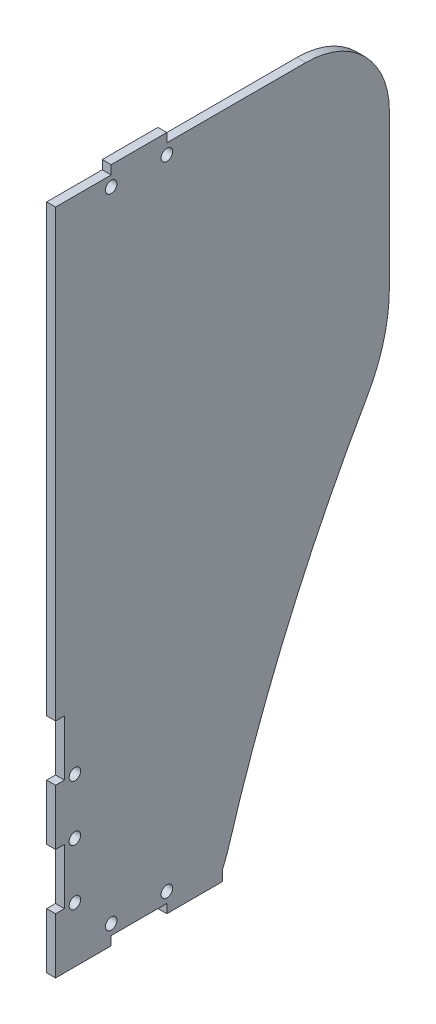
ISO-10303-21;
HEADER;
FILE_DESCRIPTION(('STEP AP214'),'2;1');
FILE_NAME('part.step','',(''),(''),'','','');
FILE_SCHEMA(('AUTOMOTIVE_DESIGN { 1 0 10303 214 1 1 1 1 }'));
ENDSEC;
DATA;
#1=APPLICATION_CONTEXT('core data for automotive mechanical design processes');
#2=APPLICATION_PROTOCOL_DEFINITION('international standard','automotive_design',2000,#1);
#3=PRODUCT_CONTEXT('',#1,'mechanical');
#4=PRODUCT('Part','Part','',(#3));
#5=PRODUCT_RELATED_PRODUCT_CATEGORY('part','',(#4));
#6=PRODUCT_DEFINITION_FORMATION('','',#4);
#7=PRODUCT_DEFINITION_CONTEXT('part definition',#1,'design');
#8=PRODUCT_DEFINITION('design','',#6,#7);
#9=PRODUCT_DEFINITION_SHAPE('','',#8);
#10=(LENGTH_UNIT() NAMED_UNIT(*) SI_UNIT(.MILLI.,.METRE.));
#11=(NAMED_UNIT(*) PLANE_ANGLE_UNIT() SI_UNIT($,.RADIAN.));
#12=(NAMED_UNIT(*) SI_UNIT($,.STERADIAN.) SOLID_ANGLE_UNIT());
#13=UNCERTAINTY_MEASURE_WITH_UNIT(LENGTH_MEASURE(1.E-05),#10,'distance_accuracy_value','');
#14=(GEOMETRIC_REPRESENTATION_CONTEXT(3) GLOBAL_UNCERTAINTY_ASSIGNED_CONTEXT((#13)) GLOBAL_UNIT_ASSIGNED_CONTEXT((#10,
#11,#12)) REPRESENTATION_CONTEXT('',''));
#15=CARTESIAN_POINT('',(0.,0.,0.));
#16=DIRECTION('',(0.,0.,1.));
#17=DIRECTION('',(1.,0.,0.));
#18=AXIS2_PLACEMENT_3D('',#15,#16,#17);
#19=CARTESIAN_POINT('',(0.,-416.449999966,33.3375));
#20=DIRECTION('',(-1.,0.,0.));
#21=DIRECTION('',(0.,0.,1.));
#22=AXIS2_PLACEMENT_3D('',#19,#20,#21);
#23=CYLINDRICAL_SURFACE('',#22,38.0999999999999);
#24=DIRECTION('',(1.,0.,0.));
#25=VECTOR('',#24,1.);
#26=CARTESIAN_POINT('',(0.,-378.350000009677,33.3375));
#27=LINE('',#26,#25);
#28=CARTESIAN_POINT('',(-4.064,-378.349999987839,33.3375));
#29=VERTEX_POINT('',#28);
#30=CARTESIAN_POINT('',(0.,-378.349999987839,33.3375));
#31=VERTEX_POINT('',#30);
#32=EDGE_CURVE('E360',#29,#31,#27,.T.);
#33=ORIENTED_EDGE('',*,*,#32,.T.);
#34=CARTESIAN_POINT('',(0.,-416.449999966,33.3375));
#35=DIRECTION('',(-1.,0.,0.));
#36=DIRECTION('',(0.,0.,1.));
#37=AXIS2_PLACEMENT_3D('',#34,#35,#36);
#38=CIRCLE('',#37,38.0999999999999);
#39=CARTESIAN_POINT('',(0.,-416.449999966,-4.76250000008065));
#40=VERTEX_POINT('',#39);
#41=EDGE_CURVE('E211',#31,#40,#38,.T.);
#42=ORIENTED_EDGE('',*,*,#41,.T.);
#43=DIRECTION('',(1.,0.,0.));
#44=VECTOR('',#43,1.);
#45=CARTESIAN_POINT('',(0.,-416.449999966,-4.76250000016129));
#46=LINE('',#45,#44);
#47=CARTESIAN_POINT('',(-4.06399999987097,-416.449999966,-4.76250000012097));
#48=VERTEX_POINT('',#47);
#49=EDGE_CURVE('E362',#40,#48,#46,.F.);
#50=ORIENTED_EDGE('',*,*,#49,.T.);
#51=CARTESIAN_POINT('',(-4.064,-416.449999966,33.3375));
#52=DIRECTION('',(-1.,0.,0.));
#53=DIRECTION('',(0.,0.,1.));
#54=AXIS2_PLACEMENT_3D('',#51,#52,#53);
#55=CIRCLE('',#54,38.0999999999999);
#56=EDGE_CURVE('E237',#48,#29,#55,.F.);
#57=ORIENTED_EDGE('',*,*,#56,.T.);
#58=EDGE_LOOP('',(#33,#42,#50,#57));
#59=FACE_BOUND('',#58,.T.);
#60=ADVANCED_FACE('F17',(#59),#23,.T.);
#61=CARTESIAN_POINT('',(0.,0.,122.237499976613));
#62=DIRECTION('',(0.,0.,-1.));
#63=DIRECTION('',(-1.,0.,0.));
#64=AXIS2_PLACEMENT_3D('',#61,#62,#63);
#65=PLANE('',#64);
#66=DIRECTION('',(1.,0.,0.));
#67=VECTOR('',#66,1.);
#68=CARTESIAN_POINT('',(0.,-378.350000009677,122.2375));
#69=LINE('',#68,#67);
#70=CARTESIAN_POINT('',(-4.06399999974193,-378.349999980559,122.2375));
#71=VERTEX_POINT('',#70);
#72=CARTESIAN_POINT('',(0.,-378.349999980559,122.237499996102));
#73=VERTEX_POINT('',#72);
#74=EDGE_CURVE('E382',#71,#73,#69,.T.);
#75=ORIENTED_EDGE('',*,*,#74,.T.);
#76=DIRECTION('',(0.,1.,0.));
#77=VECTOR('',#76,1.);
#78=CARTESIAN_POINT('',(0.,0.,122.2375));
#79=LINE('',#78,#77);
#80=CARTESIAN_POINT('',(0.,-374.28599999443,122.2375));
#81=VERTEX_POINT('',#80);
#82=EDGE_CURVE('E345',#73,#81,#79,.T.);
#83=ORIENTED_EDGE('',*,*,#82,.T.);
#84=DIRECTION('',(1.,0.,0.));
#85=VECTOR('',#84,1.);
#86=CARTESIAN_POINT('',(0.,-374.286000008645,122.2375));
#87=LINE('',#86,#85);
#88=CARTESIAN_POINT('',(-4.06399999982796,-374.285999980215,122.2375));
#89=VERTEX_POINT('',#88);
#90=EDGE_CURVE('E240',#81,#89,#87,.F.);
#91=ORIENTED_EDGE('',*,*,#90,.T.);
#92=DIRECTION('',(0.,1.,0.));
#93=VECTOR('',#92,1.);
#94=CARTESIAN_POINT('',(-4.06399999974193,0.,122.2375));
#95=LINE('',#94,#93);
#96=EDGE_CURVE('E375',#89,#71,#95,.F.);
#97=ORIENTED_EDGE('',*,*,#96,.T.);
#98=EDGE_LOOP('',(#75,#83,#91,#97));
#99=FACE_BOUND('',#98,.T.);
#100=ADVANCED_FACE('F546',(#99),#65,.F.);
#101=CARTESIAN_POINT('',(0.,-378.350000009677,0.));
#102=DIRECTION('',(0.,-1.,0.));
#103=DIRECTION('',(0.,0.,-1.));
#104=AXIS2_PLACEMENT_3D('',#101,#102,#103);
#105=PLANE('',#104);
#106=DIRECTION('',(0.,0.,1.));
#107=VECTOR('',#106,1.);
#108=CARTESIAN_POINT('',(-4.06399999974193,-378.349999966,0.));
#109=LINE('',#108,#107);
#110=CARTESIAN_POINT('',(-4.06399999974193,-378.349999966,147.637500005108));
#111=VERTEX_POINT('',#110);
#112=EDGE_CURVE('E379',#71,#111,#109,.T.);
#113=ORIENTED_EDGE('',*,*,#112,.T.);
#114=DIRECTION('',(1.,0.,0.));
#115=VECTOR('',#114,1.);
#116=CARTESIAN_POINT('',(0.,-378.349999966,147.637500015323));
#117=LINE('',#116,#115);
#118=CARTESIAN_POINT('',(0.,-378.34999997328,147.637500005108));
#119=VERTEX_POINT('',#118);
#120=EDGE_CURVE('E384',#111,#119,#117,.T.);
#121=ORIENTED_EDGE('',*,*,#120,.T.);
#122=DIRECTION('',(0.,0.,1.));
#123=VECTOR('',#122,1.);
#124=CARTESIAN_POINT('',(0.,-378.349999966,0.));
#125=LINE('',#124,#123);
#126=EDGE_CURVE('E340',#119,#73,#125,.F.);
#127=ORIENTED_EDGE('',*,*,#126,.T.);
#128=ORIENTED_EDGE('',*,*,#74,.F.);
#129=EDGE_LOOP('',(#113,#121,#127,#128));
#130=FACE_BOUND('',#129,.T.);
#131=ADVANCED_FACE('F553',(#130),#105,.F.);
#132=CARTESIAN_POINT('',(0.,0.,147.637500015323));
#133=DIRECTION('',(0.,0.,1.));
#134=DIRECTION('',(1.,0.,0.));
#135=AXIS2_PLACEMENT_3D('',#132,#133,#134);
#136=PLANE('',#135);
#137=DIRECTION('',(0.,1.,0.));
#138=VECTOR('',#137,1.);
#139=CARTESIAN_POINT('',(0.,0.,147.6375));
#140=LINE('',#139,#138);
#141=CARTESIAN_POINT('',(0.,-581.549999976258,147.637500002554));
#142=VERTEX_POINT('',#141);
#143=EDGE_CURVE('E335',#142,#119,#140,.T.);
#144=ORIENTED_EDGE('',*,*,#143,.T.);
#145=ORIENTED_EDGE('',*,*,#120,.F.);
#146=DIRECTION('',(0.,1.,0.));
#147=VECTOR('',#146,1.);
#148=CARTESIAN_POINT('',(-4.06399999974193,0.,147.6375));
#149=LINE('',#148,#147);
#150=CARTESIAN_POINT('',(-4.06399999974193,-581.549999976258,147.6375));
#151=VERTEX_POINT('',#150);
#152=EDGE_CURVE('E388',#111,#151,#149,.F.);
#153=ORIENTED_EDGE('',*,*,#152,.T.);
#154=DIRECTION('',(1.,0.,0.));
#155=VECTOR('',#154,1.);
#156=CARTESIAN_POINT('',(0.,-581.549999996774,147.6375));
#157=LINE('',#156,#155);
#158=EDGE_CURVE('E392',#151,#142,#157,.T.);
#159=ORIENTED_EDGE('',*,*,#158,.T.);
#160=EDGE_LOOP('',(#144,#145,#153,#159));
#161=FACE_BOUND('',#160,.T.);
#162=ADVANCED_FACE('F557',(#161),#136,.T.);
#163=CARTESIAN_POINT('',(0.,-581.549999996774,0.));
#164=DIRECTION('',(0.,-1.,0.));
#165=DIRECTION('',(0.,0.,-1.));
#166=AXIS2_PLACEMENT_3D('',#163,#164,#165);
#167=PLANE('',#166);
#168=DIRECTION('',(0.,0.,1.));
#169=VECTOR('',#168,1.);
#170=CARTESIAN_POINT('',(0.,-581.549999966,0.));
#171=LINE('',#170,#169);
#172=CARTESIAN_POINT('',(0.,-581.549999971129,143.573500004763));
#173=VERTEX_POINT('',#172);
#174=EDGE_CURVE('E330',#173,#142,#171,.T.);
#175=ORIENTED_EDGE('',*,*,#174,.T.);
#176=ORIENTED_EDGE('',*,*,#158,.F.);
#177=DIRECTION('',(0.,0.,1.));
#178=VECTOR('',#177,1.);
#179=CARTESIAN_POINT('',(-4.06399999974193,-581.549999966,0.));
#180=LINE('',#179,#178);
#181=CARTESIAN_POINT('',(-4.06399999974193,-581.549999966,143.573500004763));
#182=VERTEX_POINT('',#181);
#183=EDGE_CURVE('E396',#151,#182,#180,.F.);
#184=ORIENTED_EDGE('',*,*,#183,.T.);
#185=DIRECTION('',(1.,0.,0.));
#186=VECTOR('',#185,1.);
#187=CARTESIAN_POINT('',(0.,-581.549999966,143.57350001429));
#188=LINE('',#187,#186);
#189=EDGE_CURVE('E400',#182,#173,#188,.T.);
#190=ORIENTED_EDGE('',*,*,#189,.T.);
#191=EDGE_LOOP('',(#175,#176,#184,#190));
#192=FACE_BOUND('',#191,.T.);
#193=ADVANCED_FACE('F561',(#192),#167,.T.);
#194=CARTESIAN_POINT('',(0.,0.,143.57350001429));
#195=DIRECTION('',(0.,0.,1.));
#196=DIRECTION('',(1.,0.,0.));
#197=AXIS2_PLACEMENT_3D('',#194,#195,#196);
#198=PLANE('',#197);
#199=DIRECTION('',(0.,1.,0.));
#200=VECTOR('',#199,1.);
#201=CARTESIAN_POINT('',(0.,0.,143.5735));
#202=LINE('',#201,#200);
#203=CARTESIAN_POINT('',(0.,-606.949999967656,143.573500002382));
#204=VERTEX_POINT('',#203);
#205=EDGE_CURVE('E325',#204,#173,#202,.T.);
#206=ORIENTED_EDGE('',*,*,#205,.T.);
#207=ORIENTED_EDGE('',*,*,#189,.F.);
#208=DIRECTION('',(0.,1.,0.));
#209=VECTOR('',#208,1.);
#210=CARTESIAN_POINT('',(-4.06399999974193,0.,143.5735));
#211=LINE('',#210,#209);
#212=CARTESIAN_POINT('',(-4.06399999974193,-606.949999967656,143.5735));
#213=VERTEX_POINT('',#212);
#214=EDGE_CURVE('E404',#182,#213,#211,.F.);
#215=ORIENTED_EDGE('',*,*,#214,.T.);
#216=DIRECTION('',(1.,0.,0.));
#217=VECTOR('',#216,1.);
#218=CARTESIAN_POINT('',(0.,-606.949999970968,143.5735));
#219=LINE('',#218,#217);
#220=EDGE_CURVE('E408',#213,#204,#219,.T.);
#221=ORIENTED_EDGE('',*,*,#220,.T.);
#222=EDGE_LOOP('',(#206,#207,#215,#221));
#223=FACE_BOUND('',#222,.T.);
#224=ADVANCED_FACE('F567',(#223),#198,.T.);
#225=CARTESIAN_POINT('',(0.,-606.949999970968,0.));
#226=DIRECTION('',(0.,-1.,0.));
#227=DIRECTION('',(0.,0.,-1.));
#228=AXIS2_PLACEMENT_3D('',#225,#226,#227);
#229=PLANE('',#228);
#230=DIRECTION('',(1.,0.,0.));
#231=VECTOR('',#230,1.);
#232=CARTESIAN_POINT('',(0.,-606.949999966,147.637500015323));
#233=LINE('',#232,#231);
#234=CARTESIAN_POINT('',(-4.06399999974193,-606.949999966,147.637500005108));
#235=VERTEX_POINT('',#234);
#236=CARTESIAN_POINT('',(0.,-606.949999966828,147.637500005108));
#237=VERTEX_POINT('',#236);
#238=EDGE_CURVE('E416',#235,#237,#233,.T.);
#239=ORIENTED_EDGE('',*,*,#238,.T.);
#240=DIRECTION('',(0.,0.,1.));
#241=VECTOR('',#240,1.);
#242=CARTESIAN_POINT('',(0.,-606.949999966,0.));
#243=LINE('',#242,#241);
#244=EDGE_CURVE('E320',#237,#204,#243,.F.);
#245=ORIENTED_EDGE('',*,*,#244,.T.);
#246=ORIENTED_EDGE('',*,*,#220,.F.);
#247=DIRECTION('',(0.,0.,1.));
#248=VECTOR('',#247,1.);
#249=CARTESIAN_POINT('',(-4.06399999974193,-606.949999966,0.));
#250=LINE('',#249,#248);
#251=EDGE_CURVE('E412',#213,#235,#250,.T.);
#252=ORIENTED_EDGE('',*,*,#251,.T.);
#253=EDGE_LOOP('',(#239,#245,#246,#252));
#254=FACE_BOUND('',#253,.T.);
#255=ADVANCED_FACE('F572',(#254),#229,.F.);
#256=CARTESIAN_POINT('',(0.,0.,147.637500015323));
#257=DIRECTION('',(0.,0.,1.));
#258=DIRECTION('',(1.,0.,0.));
#259=AXIS2_PLACEMENT_3D('',#256,#257,#258);
#260=PLANE('',#259);
#261=DIRECTION('',(0.,1.,0.));
#262=VECTOR('',#261,1.);
#263=CARTESIAN_POINT('',(0.,0.,147.6375));
#264=LINE('',#263,#262);
#265=CARTESIAN_POINT('',(0.,-632.349999980559,147.637500002554));
#266=VERTEX_POINT('',#265);
#267=EDGE_CURVE('E315',#266,#237,#264,.T.);
#268=ORIENTED_EDGE('',*,*,#267,.T.);
#269=ORIENTED_EDGE('',*,*,#238,.F.);
#270=DIRECTION('',(0.,1.,0.));
#271=VECTOR('',#270,1.);
#272=CARTESIAN_POINT('',(-4.06399999974193,0.,147.6375));
#273=LINE('',#272,#271);
#274=CARTESIAN_POINT('',(-4.06399999974193,-632.349999980559,147.6375));
#275=VERTEX_POINT('',#274);
#276=EDGE_CURVE('E420',#235,#275,#273,.F.);
#277=ORIENTED_EDGE('',*,*,#276,.T.);
#278=DIRECTION('',(1.,0.,0.));
#279=VECTOR('',#278,1.);
#280=CARTESIAN_POINT('',(0.,-632.350000009677,147.6375));
#281=LINE('',#280,#279);
#282=EDGE_CURVE('E424',#275,#266,#281,.T.);
#283=ORIENTED_EDGE('',*,*,#282,.T.);
#284=EDGE_LOOP('',(#268,#269,#277,#283));
#285=FACE_BOUND('',#284,.T.);
#286=ADVANCED_FACE('F576',(#285),#260,.T.);
#287=CARTESIAN_POINT('',(0.,-632.350000009677,0.));
#288=DIRECTION('',(0.,-1.,0.));
#289=DIRECTION('',(0.,0.,-1.));
#290=AXIS2_PLACEMENT_3D('',#287,#288,#289);
#291=PLANE('',#290);
#292=DIRECTION('',(0.,0.,1.));
#293=VECTOR('',#292,1.);
#294=CARTESIAN_POINT('',(0.,-632.349999966,0.));
#295=LINE('',#294,#293);
#296=CARTESIAN_POINT('',(0.,-632.349999973279,143.573500004763));
#297=VERTEX_POINT('',#296);
#298=EDGE_CURVE('E310',#297,#266,#295,.T.);
#299=ORIENTED_EDGE('',*,*,#298,.T.);
#300=ORIENTED_EDGE('',*,*,#282,.F.);
#301=DIRECTION('',(0.,0.,1.));
#302=VECTOR('',#301,1.);
#303=CARTESIAN_POINT('',(-4.06399999974193,-632.349999966,0.));
#304=LINE('',#303,#302);
#305=CARTESIAN_POINT('',(-4.06399999974193,-632.349999966,143.573500004763));
#306=VERTEX_POINT('',#305);
#307=EDGE_CURVE('E428',#275,#306,#304,.F.);
#308=ORIENTED_EDGE('',*,*,#307,.T.);
#309=DIRECTION('',(1.,0.,0.));
#310=VECTOR('',#309,1.);
#311=CARTESIAN_POINT('',(0.,-632.349999966,143.57350001429));
#312=LINE('',#311,#310);
#313=EDGE_CURVE('E432',#306,#297,#312,.T.);
#314=ORIENTED_EDGE('',*,*,#313,.T.);
#315=EDGE_LOOP('',(#299,#300,#308,#314));
#316=FACE_BOUND('',#315,.T.);
#317=ADVANCED_FACE('F582',(#316),#291,.T.);
#318=CARTESIAN_POINT('',(0.,0.,143.57350001429));
#319=DIRECTION('',(0.,0.,1.));
#320=DIRECTION('',(1.,0.,0.));
#321=AXIS2_PLACEMENT_3D('',#318,#319,#320);
#322=PLANE('',#321);
#323=DIRECTION('',(0.,1.,0.));
#324=VECTOR('',#323,1.);
#325=CARTESIAN_POINT('',(0.,0.,143.5735));
#326=LINE('',#325,#324);
#327=CARTESIAN_POINT('',(0.,-657.749999971957,143.573500002382));
#328=VERTEX_POINT('',#327);
#329=EDGE_CURVE('E305',#328,#297,#326,.T.);
#330=ORIENTED_EDGE('',*,*,#329,.T.);
#331=ORIENTED_EDGE('',*,*,#313,.F.);
#332=DIRECTION('',(0.,1.,0.));
#333=VECTOR('',#332,1.);
#334=CARTESIAN_POINT('',(-4.06399999974193,0.,143.5735));
#335=LINE('',#334,#333);
#336=CARTESIAN_POINT('',(-4.06399999974193,-657.749999971957,143.5735));
#337=VERTEX_POINT('',#336);
#338=EDGE_CURVE('E436',#306,#337,#335,.F.);
#339=ORIENTED_EDGE('',*,*,#338,.T.);
#340=DIRECTION('',(1.,0.,0.));
#341=VECTOR('',#340,1.);
#342=CARTESIAN_POINT('',(0.,-657.749999983871,143.5735));
#343=LINE('',#342,#341);
#344=EDGE_CURVE('E440',#337,#328,#343,.T.);
#345=ORIENTED_EDGE('',*,*,#344,.T.);
#346=EDGE_LOOP('',(#330,#331,#339,#345));
#347=FACE_BOUND('',#346,.T.);
#348=ADVANCED_FACE('F587',(#347),#322,.T.);
#349=CARTESIAN_POINT('',(0.,-657.749999983871,0.));
#350=DIRECTION('',(0.,-1.,0.));
#351=DIRECTION('',(0.,0.,-1.));
#352=AXIS2_PLACEMENT_3D('',#349,#350,#351);
#353=PLANE('',#352);
#354=DIRECTION('',(1.,0.,0.));
#355=VECTOR('',#354,1.);
#356=CARTESIAN_POINT('',(0.,-657.749999966,147.637500015323));
#357=LINE('',#356,#355);
#358=CARTESIAN_POINT('',(-4.06399999974193,-657.749999966,147.637500005108));
#359=VERTEX_POINT('',#358);
#360=CARTESIAN_POINT('',(0.,-657.749999968978,147.637500005108));
#361=VERTEX_POINT('',#360);
#362=EDGE_CURVE('E448',#359,#361,#357,.T.);
#363=ORIENTED_EDGE('',*,*,#362,.T.);
#364=DIRECTION('',(0.,0.,1.));
#365=VECTOR('',#364,1.);
#366=CARTESIAN_POINT('',(0.,-657.749999966,0.));
#367=LINE('',#366,#365);
#368=EDGE_CURVE('E300',#361,#328,#367,.F.);
#369=ORIENTED_EDGE('',*,*,#368,.T.);
#370=ORIENTED_EDGE('',*,*,#344,.F.);
#371=DIRECTION('',(0.,0.,1.));
#372=VECTOR('',#371,1.);
#373=CARTESIAN_POINT('',(-4.06399999974193,-657.749999966,0.));
#374=LINE('',#373,#372);
#375=EDGE_CURVE('E444',#337,#359,#374,.T.);
#376=ORIENTED_EDGE('',*,*,#375,.T.);
#377=EDGE_LOOP('',(#363,#369,#370,#376));
#378=FACE_BOUND('',#377,.T.);
#379=ADVANCED_FACE('F591',(#378),#353,.F.);
#380=CARTESIAN_POINT('',(0.,0.,147.637500015323));
#381=DIRECTION('',(0.,0.,1.));
#382=DIRECTION('',(1.,0.,0.));
#383=AXIS2_PLACEMENT_3D('',#380,#381,#382);
#384=PLANE('',#383);
#385=DIRECTION('',(0.,1.,0.));
#386=VECTOR('',#385,1.);
#387=CARTESIAN_POINT('',(0.,0.,147.6375));
#388=LINE('',#387,#386);
#389=CARTESIAN_POINT('',(0.,-683.150000027871,147.637500002554));
#390=VERTEX_POINT('',#389);
#391=EDGE_CURVE('E295',#390,#361,#388,.T.);
#392=ORIENTED_EDGE('',*,*,#391,.T.);
#393=ORIENTED_EDGE('',*,*,#362,.F.);
#394=DIRECTION('',(0.,1.,0.));
#395=VECTOR('',#394,1.);
#396=CARTESIAN_POINT('',(-4.06399999974193,0.,147.6375));
#397=LINE('',#396,#395);
#398=CARTESIAN_POINT('',(-4.06399999974193,-683.150000027871,147.6375));
#399=VERTEX_POINT('',#398);
#400=EDGE_CURVE('E452',#359,#399,#397,.F.);
#401=ORIENTED_EDGE('',*,*,#400,.T.);
#402=DIRECTION('',(1.,0.,0.));
#403=VECTOR('',#402,1.);
#404=CARTESIAN_POINT('',(0.,-683.150000151612,147.6375));
#405=LINE('',#404,#403);
#406=EDGE_CURVE('E456',#399,#390,#405,.T.);
#407=ORIENTED_EDGE('',*,*,#406,.T.);
#408=EDGE_LOOP('',(#392,#393,#401,#407));
#409=FACE_BOUND('',#408,.T.);
#410=ADVANCED_FACE('F597',(#409),#384,.T.);
#411=CARTESIAN_POINT('',(0.,-683.150000151612,0.));
#412=DIRECTION('',(0.,-1.,0.));
#413=DIRECTION('',(0.,0.,-1.));
#414=AXIS2_PLACEMENT_3D('',#411,#412,#413);
#415=PLANE('',#414);
#416=DIRECTION('',(0.,0.,1.));
#417=VECTOR('',#416,1.);
#418=CARTESIAN_POINT('',(0.,-683.149999966,0.));
#419=LINE('',#418,#417);
#420=CARTESIAN_POINT('',(0.,-683.149999996935,122.237499992204));
#421=VERTEX_POINT('',#420);
#422=EDGE_CURVE('E290',#421,#390,#419,.T.);
#423=ORIENTED_EDGE('',*,*,#422,.T.);
#424=ORIENTED_EDGE('',*,*,#406,.F.);
#425=DIRECTION('',(0.,0.,1.));
#426=VECTOR('',#425,1.);
#427=CARTESIAN_POINT('',(-4.06399999974193,-683.149999966,0.));
#428=LINE('',#427,#426);
#429=CARTESIAN_POINT('',(-4.06399999974193,-683.149999966,122.237499992204));
#430=VERTEX_POINT('',#429);
#431=EDGE_CURVE('E460',#399,#430,#428,.F.);
#432=ORIENTED_EDGE('',*,*,#431,.T.);
#433=DIRECTION('',(-1.,0.,0.));
#434=VECTOR('',#433,1.);
#435=CARTESIAN_POINT('',(0.,-683.149999966,122.237499976613));
#436=LINE('',#435,#434);
#437=EDGE_CURVE('E464',#430,#421,#436,.F.);
#438=ORIENTED_EDGE('',*,*,#437,.T.);
#439=EDGE_LOOP('',(#423,#424,#432,#438));
#440=FACE_BOUND('',#439,.T.);
#441=ADVANCED_FACE('F602',(#440),#415,.T.);
#442=CARTESIAN_POINT('',(0.,0.,122.237499976613));
#443=DIRECTION('',(0.,0.,-1.));
#444=DIRECTION('',(-1.,0.,0.));
#445=AXIS2_PLACEMENT_3D('',#442,#443,#444);
#446=PLANE('',#445);
#447=DIRECTION('',(0.,1.,0.));
#448=VECTOR('',#447,1.);
#449=CARTESIAN_POINT('',(0.,0.,122.2375));
#450=LINE('',#449,#448);
#451=CARTESIAN_POINT('',(0.,-679.085999941505,122.237499996102));
#452=VERTEX_POINT('',#451);
#453=EDGE_CURVE('E285',#452,#421,#450,.F.);
#454=ORIENTED_EDGE('',*,*,#453,.T.);
#455=ORIENTED_EDGE('',*,*,#437,.F.);
#456=DIRECTION('',(0.,1.,0.));
#457=VECTOR('',#456,1.);
#458=CARTESIAN_POINT('',(-4.06399999974193,0.,122.2375));
#459=LINE('',#458,#457);
#460=CARTESIAN_POINT('',(-4.06399999974193,-679.085999941505,122.2375));
#461=VERTEX_POINT('',#460);
#462=EDGE_CURVE('E468',#430,#461,#459,.T.);
#463=ORIENTED_EDGE('',*,*,#462,.T.);
#464=DIRECTION('',(1.,0.,0.));
#465=VECTOR('',#464,1.);
#466=CARTESIAN_POINT('',(0.,-679.085999892516,122.2375));
#467=LINE('',#466,#465);
#468=EDGE_CURVE('E472',#461,#452,#467,.T.);
#469=ORIENTED_EDGE('',*,*,#468,.T.);
#470=EDGE_LOOP('',(#454,#455,#463,#469));
#471=FACE_BOUND('',#470,.T.);
#472=ADVANCED_FACE('F606',(#471),#446,.T.);
#473=CARTESIAN_POINT('',(0.,-679.085999892516,0.));
#474=DIRECTION('',(0.,1.,0.));
#475=DIRECTION('',(0.,0.,1.));
#476=AXIS2_PLACEMENT_3D('',#473,#474,#475);
#477=PLANE('',#476);
#478=DIRECTION('',(-1.,0.,0.));
#479=VECTOR('',#478,1.);
#480=CARTESIAN_POINT('',(0.,-679.085999966,96.8375000024193));
#481=LINE('',#480,#479);
#482=CARTESIAN_POINT('',(-4.06399999974193,-679.085999966,96.8375000008064));
#483=VERTEX_POINT('',#482);
#484=CARTESIAN_POINT('',(0.,-679.085999953753,96.8375000008064));
#485=VERTEX_POINT('',#484);
#486=EDGE_CURVE('E480',#483,#485,#481,.F.);
#487=ORIENTED_EDGE('',*,*,#486,.T.);
#488=DIRECTION('',(0.,0.,1.));
#489=VECTOR('',#488,1.);
#490=CARTESIAN_POINT('',(0.,-679.085999966,0.));
#491=LINE('',#490,#489);
#492=EDGE_CURVE('E280',#485,#452,#491,.T.);
#493=ORIENTED_EDGE('',*,*,#492,.T.);
#494=ORIENTED_EDGE('',*,*,#468,.F.);
#495=DIRECTION('',(0.,0.,1.));
#496=VECTOR('',#495,1.);
#497=CARTESIAN_POINT('',(-4.06399999974193,-679.085999966,0.));
#498=LINE('',#497,#496);
#499=EDGE_CURVE('E476',#461,#483,#498,.F.);
#500=ORIENTED_EDGE('',*,*,#499,.T.);
#501=EDGE_LOOP('',(#487,#493,#494,#500));
#502=FACE_BOUND('',#501,.T.);
#503=ADVANCED_FACE('F612',(#502),#477,.F.);
#504=CARTESIAN_POINT('',(0.,0.,96.8375000024193));
#505=DIRECTION('',(0.,0.,-1.));
#506=DIRECTION('',(-1.,0.,0.));
#507=AXIS2_PLACEMENT_3D('',#504,#505,#506);
#508=PLANE('',#507);
#509=DIRECTION('',(1.,0.,0.));
#510=VECTOR('',#509,1.);
#511=CARTESIAN_POINT('',(0.,-683.150000151612,96.8375));
#512=LINE('',#511,#510);
#513=CARTESIAN_POINT('',(-4.06399999974193,-683.150000027871,96.8375));
#514=VERTEX_POINT('',#513);
#515=CARTESIAN_POINT('',(0.,-683.150000027871,96.8375000004032));
#516=VERTEX_POINT('',#515);
#517=EDGE_CURVE('E488',#514,#516,#512,.T.);
#518=ORIENTED_EDGE('',*,*,#517,.T.);
#519=DIRECTION('',(0.,1.,0.));
#520=VECTOR('',#519,1.);
#521=CARTESIAN_POINT('',(0.,0.,96.8375));
#522=LINE('',#521,#520);
#523=EDGE_CURVE('E275',#516,#485,#522,.T.);
#524=ORIENTED_EDGE('',*,*,#523,.T.);
#525=ORIENTED_EDGE('',*,*,#486,.F.);
#526=DIRECTION('',(0.,1.,0.));
#527=VECTOR('',#526,1.);
#528=CARTESIAN_POINT('',(-4.06399999974193,0.,96.8375));
#529=LINE('',#528,#527);
#530=EDGE_CURVE('E484',#483,#514,#529,.F.);
#531=ORIENTED_EDGE('',*,*,#530,.T.);
#532=EDGE_LOOP('',(#518,#524,#525,#531));
#533=FACE_BOUND('',#532,.T.);
#534=ADVANCED_FACE('F617',(#533),#508,.F.);
#535=CARTESIAN_POINT('',(0.,-683.150000151612,0.));
#536=DIRECTION('',(0.,-1.,0.));
#537=DIRECTION('',(0.,0.,-1.));
#538=AXIS2_PLACEMENT_3D('',#535,#536,#537);
#539=PLANE('',#538);
#540=DIRECTION('',(0.,0.,1.));
#541=VECTOR('',#540,1.);
#542=CARTESIAN_POINT('',(0.,-683.149999966,0.));
#543=LINE('',#542,#541);
#544=CARTESIAN_POINT('',(0.,-683.149999966,71.4375000094086));
#545=VERTEX_POINT('',#544);
#546=EDGE_CURVE('E272',#545,#516,#543,.T.);
#547=ORIENTED_EDGE('',*,*,#546,.T.);
#548=ORIENTED_EDGE('',*,*,#517,.F.);
#549=DIRECTION('',(0.,0.,1.));
#550=VECTOR('',#549,1.);
#551=CARTESIAN_POINT('',(-4.06399999974193,-683.149999966,0.));
#552=LINE('',#551,#550);
#553=CARTESIAN_POINT('',(-4.06399999974193,-683.149999966,71.4375000094086));
#554=VERTEX_POINT('',#553);
#555=EDGE_CURVE('E492',#514,#554,#552,.F.);
#556=ORIENTED_EDGE('',*,*,#555,.T.);
#557=DIRECTION('',(1.,0.,0.));
#558=VECTOR('',#557,1.);
#559=CARTESIAN_POINT('',(0.,-683.149999966,71.4375000282257));
#560=LINE('',#559,#558);
#561=EDGE_CURVE('E496',#554,#545,#560,.T.);
#562=ORIENTED_EDGE('',*,*,#561,.T.);
#563=EDGE_LOOP('',(#547,#548,#556,#562));
#564=FACE_BOUND('',#563,.T.);
#565=ADVANCED_FACE('F621',(#564),#539,.T.);
#566=CARTESIAN_POINT('',(0.,0.,71.4375000282257));
#567=DIRECTION('',(0.,0.,1.));
#568=DIRECTION('',(1.,0.,0.));
#569=AXIS2_PLACEMENT_3D('',#566,#567,#568);
#570=PLANE('',#569);
#571=DIRECTION('',(1.,0.,0.));
#572=VECTOR('',#571,1.);
#573=CARTESIAN_POINT('',(-2.032,-678.32399997844,71.437499973382));
#574=LINE('',#573,#572);
#575=CARTESIAN_POINT('',(-4.064,-678.324000006918,71.437499986691));
#576=VERTEX_POINT('',#575);
#577=CARTESIAN_POINT('',(0.,-678.324000006918,71.437499986691));
#578=VERTEX_POINT('',#577);
#579=EDGE_CURVE('E503',#576,#578,#574,.T.);
#580=ORIENTED_EDGE('',*,*,#579,.T.);
#581=DIRECTION('',(0.,1.,0.));
#582=VECTOR('',#581,1.);
#583=CARTESIAN_POINT('',(0.,0.,71.4375));
#584=LINE('',#583,#582);
#585=EDGE_CURVE('E208',#578,#545,#584,.F.);
#586=ORIENTED_EDGE('',*,*,#585,.T.);
#587=ORIENTED_EDGE('',*,*,#561,.F.);
#588=DIRECTION('',(0.,1.,0.));
#589=VECTOR('',#588,1.);
#590=CARTESIAN_POINT('',(-4.06399999974193,0.,71.4375));
#591=LINE('',#590,#589);
#592=EDGE_CURVE('E243',#554,#576,#591,.T.);
#593=ORIENTED_EDGE('',*,*,#592,.T.);
#594=EDGE_LOOP('',(#580,#586,#587,#593));
#595=FACE_BOUND('',#594,.T.);
#596=ADVANCED_FACE('F624',(#595),#570,.F.);
#597=CARTESIAN_POINT('',(0.,-654.96144598,121.4276305504));
#598=DIRECTION('',(-1.,0.,0.));
#599=DIRECTION('',(0.,0.,1.));
#600=AXIS2_PLACEMENT_3D('',#597,#598,#599);
#601=CYLINDRICAL_SURFACE('',#600,55.1799065279864);
#602=CARTESIAN_POINT('',(0.,-654.96144598,121.4276305504));
#603=DIRECTION('',(-1.,0.,0.));
#604=DIRECTION('',(0.,0.,1.));
#605=AXIS2_PLACEMENT_3D('',#602,#603,#604);
#606=CIRCLE('',#605,55.1799065279864);
#607=CARTESIAN_POINT('',(0.,-670.885739746705,68.5954533051926));
#608=VERTEX_POINT('',#607);
#609=EDGE_CURVE('E207',#608,#578,#606,.T.);
#610=ORIENTED_EDGE('',*,*,#609,.T.);
#611=ORIENTED_EDGE('',*,*,#579,.F.);
#612=CARTESIAN_POINT('',(-4.064,-654.96144598,121.4276305504));
#613=DIRECTION('',(-1.,0.,0.));
#614=DIRECTION('',(0.,0.,1.));
#615=AXIS2_PLACEMENT_3D('',#612,#613,#614);
#616=CIRCLE('',#615,55.1799065279864);
#617=CARTESIAN_POINT('',(-4.064,-670.885739746705,68.5954533051926));
#618=VERTEX_POINT('',#617);
#619=EDGE_CURVE('E241',#576,#618,#616,.F.);
#620=ORIENTED_EDGE('',*,*,#619,.T.);
#621=DIRECTION('',(-1.,0.,0.));
#622=VECTOR('',#621,1.);
#623=CARTESIAN_POINT('',(-2.032,-670.88573976,68.5954533092));
#624=LINE('',#623,#622);
#625=EDGE_CURVE('E196',#618,#608,#624,.F.);
#626=ORIENTED_EDGE('',*,*,#625,.T.);
#627=EDGE_LOOP('',(#610,#611,#620,#626));
#628=FACE_BOUND('',#627,.T.);
#629=ADVANCED_FACE('F629',(#628),#601,.T.);
#630=CARTESIAN_POINT('',(0.,-871.859072382,-598.175638546));
#631=DIRECTION('',(-1.,0.,0.));
#632=DIRECTION('',(0.,0.,1.));
#633=AXIS2_PLACEMENT_3D('',#630,#631,#632);
#634=CYLINDRICAL_SURFACE('',#633,696.400724697332);
#635=DIRECTION('',(1.,0.,0.));
#636=VECTOR('',#635,1.);
#637=CARTESIAN_POINT('',(-2.032,-524.47382126299,5.39495106483592));
#638=LINE('',#637,#636);
#639=CARTESIAN_POINT('',(-4.064,-524.473821270486,5.39495107775712));
#640=VERTEX_POINT('',#639);
#641=CARTESIAN_POINT('',(0.,-524.473821274207,5.39495107129222));
#642=VERTEX_POINT('',#641);
#643=EDGE_CURVE('E187',#640,#642,#638,.T.);
#644=ORIENTED_EDGE('',*,*,#643,.T.);
#645=CARTESIAN_POINT('',(0.,-871.859072382,-598.175638546));
#646=DIRECTION('',(-1.,0.,0.));
#647=DIRECTION('',(0.,0.,1.));
#648=AXIS2_PLACEMENT_3D('',#645,#646,#647);
#649=CIRCLE('',#648,696.400724697332);
#650=EDGE_CURVE('E191',#642,#608,#649,.F.);
#651=ORIENTED_EDGE('',*,*,#650,.T.);
#652=ORIENTED_EDGE('',*,*,#625,.F.);
#653=CARTESIAN_POINT('',(-4.064,-871.859072382,-598.175638546));
#654=DIRECTION('',(-1.,0.,0.));
#655=DIRECTION('',(0.,0.,1.));
#656=AXIS2_PLACEMENT_3D('',#653,#654,#655);
#657=CIRCLE('',#656,696.400724697332);
#658=EDGE_CURVE('E194',#618,#640,#657,.T.);
#659=ORIENTED_EDGE('',*,*,#658,.T.);
#660=EDGE_LOOP('',(#644,#651,#652,#659));
#661=FACE_BOUND('',#660,.T.);
#662=ADVANCED_FACE('F188',(#661),#634,.F.);
#663=CARTESIAN_POINT('',(0.,-486.463010562,71.4375));
#664=DIRECTION('',(-1.,0.,0.));
#665=DIRECTION('',(0.,0.,1.));
#666=AXIS2_PLACEMENT_3D('',#663,#664,#665);
#667=CYLINDRICAL_SURFACE('',#666,76.2);
#668=CARTESIAN_POINT('',(0.,-486.463010562,71.4375));
#669=DIRECTION('',(-1.,0.,0.));
#670=DIRECTION('',(0.,0.,1.));
#671=AXIS2_PLACEMENT_3D('',#668,#669,#670);
#672=CIRCLE('',#671,76.2);
#673=CARTESIAN_POINT('',(0.,-486.463010562,-4.76250000008065));
#674=VERTEX_POINT('',#673);
#675=EDGE_CURVE('E20',#674,#642,#672,.T.);
#676=ORIENTED_EDGE('',*,*,#675,.T.);
#677=ORIENTED_EDGE('',*,*,#643,.F.);
#678=CARTESIAN_POINT('',(-4.064,-486.463010562,71.4375));
#679=DIRECTION('',(-1.,0.,0.));
#680=DIRECTION('',(0.,0.,1.));
#681=AXIS2_PLACEMENT_3D('',#678,#679,#680);
#682=CIRCLE('',#681,76.2);
#683=CARTESIAN_POINT('',(-4.06399999987097,-486.463010562,-4.76250000012097));
#684=VERTEX_POINT('',#683);
#685=EDGE_CURVE('E245',#640,#684,#682,.F.);
#686=ORIENTED_EDGE('',*,*,#685,.T.);
#687=DIRECTION('',(1.,0.,0.));
#688=VECTOR('',#687,1.);
#689=CARTESIAN_POINT('',(0.,-486.463010562,-4.76250000016129));
#690=LINE('',#689,#688);
#691=EDGE_CURVE('E181',#684,#674,#690,.T.);
#692=ORIENTED_EDGE('',*,*,#691,.T.);
#693=EDGE_LOOP('',(#676,#677,#686,#692));
#694=FACE_BOUND('',#693,.T.);
#695=ADVANCED_FACE('F199',(#694),#667,.T.);
#696=CARTESIAN_POINT('',(0.,0.,-4.76250000016129));
#697=DIRECTION('',(0.,0.,1.));
#698=DIRECTION('',(1.,0.,0.));
#699=AXIS2_PLACEMENT_3D('',#696,#697,#698);
#700=PLANE('',#699);
#701=DIRECTION('',(0.,1.,0.));
#702=VECTOR('',#701,1.);
#703=CARTESIAN_POINT('',(0.,0.,-4.7625));
#704=LINE('',#703,#702);
#705=EDGE_CURVE('E202',#40,#674,#704,.F.);
#706=ORIENTED_EDGE('',*,*,#705,.T.);
#707=ORIENTED_EDGE('',*,*,#691,.F.);
#708=DIRECTION('',(0.,1.,0.));
#709=VECTOR('',#708,1.);
#710=CARTESIAN_POINT('',(-4.06399999974193,0.,-4.7625));
#711=LINE('',#710,#709);
#712=EDGE_CURVE('E247',#684,#48,#711,.T.);
#713=ORIENTED_EDGE('',*,*,#712,.T.);
#714=ORIENTED_EDGE('',*,*,#49,.F.);
#715=EDGE_LOOP('',(#706,#707,#713,#714));
#716=FACE_BOUND('',#715,.T.);
#717=ADVANCED_FACE('F527',(#716),#700,.F.);
#718=CARTESIAN_POINT('',(0.,-383.125199966,122.2375));
#719=DIRECTION('',(-1.,0.,0.));
#720=DIRECTION('',(0.,0.,1.));
#721=AXIS2_PLACEMENT_3D('',#718,#719,#720);
#722=CYLINDRICAL_SURFACE('',#721,2.61619999999996);
#723=CARTESIAN_POINT('',(-4.064,-383.125199966,122.2375));
#724=DIRECTION('',(-1.,0.,0.));
#725=DIRECTION('',(0.,0.,1.));
#726=AXIS2_PLACEMENT_3D('',#723,#724,#725);
#727=CIRCLE('',#726,2.61619999999996);
#728=CARTESIAN_POINT('',(-4.064,-383.125199966,124.8537));
#729=VERTEX_POINT('',#728);
#730=EDGE_CURVE('E248',#729,#729,#727,.T.);
#731=ORIENTED_EDGE('',*,*,#730,.T.);
#732=EDGE_LOOP('',(#731));
#733=FACE_BOUND('',#732,.T.);
#734=CARTESIAN_POINT('',(0.,-383.125199966,122.2375));
#735=DIRECTION('',(-1.,0.,0.));
#736=DIRECTION('',(0.,0.,1.));
#737=AXIS2_PLACEMENT_3D('',#734,#735,#736);
#738=CIRCLE('',#737,2.61620000000001);
#739=CARTESIAN_POINT('',(0.,-383.125199966,124.8537));
#740=VERTEX_POINT('',#739);
#741=EDGE_CURVE('E214',#740,#740,#738,.F.);
#742=ORIENTED_EDGE('',*,*,#741,.T.);
#743=EDGE_LOOP('',(#742));
#744=FACE_BOUND('',#743,.T.);
#745=ADVANCED_FACE('F677',(#733,#744),#722,.F.);
#746=CARTESIAN_POINT('',(0.,-383.125199966,96.8375));
#747=DIRECTION('',(-1.,0.,0.));
#748=DIRECTION('',(0.,0.,1.));
#749=AXIS2_PLACEMENT_3D('',#746,#747,#748);
#750=CYLINDRICAL_SURFACE('',#749,2.61619999999996);
#751=CARTESIAN_POINT('',(-4.064,-383.125199966,96.8375));
#752=DIRECTION('',(-1.,0.,0.));
#753=DIRECTION('',(0.,0.,1.));
#754=AXIS2_PLACEMENT_3D('',#751,#752,#753);
#755=CIRCLE('',#754,2.61619999999996);
#756=CARTESIAN_POINT('',(-4.064,-383.125199966,99.4537));
#757=VERTEX_POINT('',#756);
#758=EDGE_CURVE('E251',#757,#757,#755,.T.);
#759=ORIENTED_EDGE('',*,*,#758,.T.);
#760=EDGE_LOOP('',(#759));
#761=FACE_BOUND('',#760,.T.);
#762=CARTESIAN_POINT('',(0.,-383.125199966,96.8375));
#763=DIRECTION('',(-1.,0.,0.));
#764=DIRECTION('',(0.,0.,1.));
#765=AXIS2_PLACEMENT_3D('',#762,#763,#764);
#766=CIRCLE('',#765,2.61620000000001);
#767=CARTESIAN_POINT('',(0.,-383.125199966,99.4537));
#768=VERTEX_POINT('',#767);
#769=EDGE_CURVE('E218',#768,#768,#766,.F.);
#770=ORIENTED_EDGE('',*,*,#769,.T.);
#771=EDGE_LOOP('',(#770));
#772=FACE_BOUND('',#771,.T.);
#773=ADVANCED_FACE('F673',(#761,#772),#750,.F.);
#774=CARTESIAN_POINT('',(-4.064,-674.310799966,96.8375));
#775=DIRECTION('',(1.,0.,0.));
#776=DIRECTION('',(0.,0.,-1.));
#777=AXIS2_PLACEMENT_3D('',#774,#775,#776);
#778=CYLINDRICAL_SURFACE('',#777,2.61619999999996);
#779=CARTESIAN_POINT('',(0.,-674.310799966,96.8375));
#780=DIRECTION('',(1.,0.,0.));
#781=DIRECTION('',(0.,0.,-1.));
#782=AXIS2_PLACEMENT_3D('',#779,#780,#781);
#783=CIRCLE('',#782,2.61620000000007);
#784=CARTESIAN_POINT('',(0.,-674.310799966,94.2212999999999));
#785=VERTEX_POINT('',#784);
#786=EDGE_CURVE('E221',#785,#785,#783,.T.);
#787=ORIENTED_EDGE('',*,*,#786,.T.);
#788=EDGE_LOOP('',(#787));
#789=FACE_BOUND('',#788,.T.);
#790=CARTESIAN_POINT('',(-4.064,-674.310799966,96.8375));
#791=DIRECTION('',(1.,0.,0.));
#792=DIRECTION('',(0.,0.,-1.));
#793=AXIS2_PLACEMENT_3D('',#790,#791,#792);
#794=CIRCLE('',#793,2.61619999999996);
#795=CARTESIAN_POINT('',(-4.064,-674.310799966,94.2213));
#796=VERTEX_POINT('',#795);
#797=EDGE_CURVE('E254',#796,#796,#794,.F.);
#798=ORIENTED_EDGE('',*,*,#797,.T.);
#799=EDGE_LOOP('',(#798));
#800=FACE_BOUND('',#799,.T.);
#801=ADVANCED_FACE('F669',(#789,#800),#778,.F.);
#802=CARTESIAN_POINT('',(-4.064,-674.310799966,122.2375));
#803=DIRECTION('',(1.,0.,0.));
#804=DIRECTION('',(0.,0.,-1.));
#805=AXIS2_PLACEMENT_3D('',#802,#803,#804);
#806=CYLINDRICAL_SURFACE('',#805,2.61619999999996);
#807=CARTESIAN_POINT('',(0.,-674.310799966,122.2375));
#808=DIRECTION('',(1.,0.,0.));
#809=DIRECTION('',(0.,0.,-1.));
#810=AXIS2_PLACEMENT_3D('',#807,#808,#809);
#811=CIRCLE('',#810,2.61620000000007);
#812=CARTESIAN_POINT('',(0.,-674.310799966,119.6213));
#813=VERTEX_POINT('',#812);
#814=EDGE_CURVE('E224',#813,#813,#811,.T.);
#815=ORIENTED_EDGE('',*,*,#814,.T.);
#816=EDGE_LOOP('',(#815));
#817=FACE_BOUND('',#816,.T.);
#818=CARTESIAN_POINT('',(-4.064,-674.310799966,122.2375));
#819=DIRECTION('',(1.,0.,0.));
#820=DIRECTION('',(0.,0.,-1.));
#821=AXIS2_PLACEMENT_3D('',#818,#819,#820);
#822=CIRCLE('',#821,2.61619999999996);
#823=CARTESIAN_POINT('',(-4.064,-674.310799966,119.6213));
#824=VERTEX_POINT('',#823);
#825=EDGE_CURVE('E257',#824,#824,#822,.F.);
#826=ORIENTED_EDGE('',*,*,#825,.T.);
#827=EDGE_LOOP('',(#826));
#828=FACE_BOUND('',#827,.T.);
#829=ADVANCED_FACE('F665',(#817,#828),#806,.F.);
#830=CARTESIAN_POINT('',(-4.064,-657.749999966,138.7983));
#831=DIRECTION('',(1.,0.,0.));
#832=DIRECTION('',(0.,0.,-1.));
#833=AXIS2_PLACEMENT_3D('',#830,#831,#832);
#834=CYLINDRICAL_SURFACE('',#833,2.61619999999996);
#835=CARTESIAN_POINT('',(0.,-657.749999966,138.7983));
#836=DIRECTION('',(1.,0.,0.));
#837=DIRECTION('',(0.,0.,-1.));
#838=AXIS2_PLACEMENT_3D('',#835,#836,#837);
#839=CIRCLE('',#838,2.61620000000007);
#840=CARTESIAN_POINT('',(0.,-657.749999966,136.1821));
#841=VERTEX_POINT('',#840);
#842=EDGE_CURVE('E227',#841,#841,#839,.T.);
#843=ORIENTED_EDGE('',*,*,#842,.T.);
#844=EDGE_LOOP('',(#843));
#845=FACE_BOUND('',#844,.T.);
#846=CARTESIAN_POINT('',(-4.064,-657.749999966,138.7983));
#847=DIRECTION('',(1.,0.,0.));
#848=DIRECTION('',(0.,0.,-1.));
#849=AXIS2_PLACEMENT_3D('',#846,#847,#848);
#850=CIRCLE('',#849,2.61619999999996);
#851=CARTESIAN_POINT('',(-4.064,-657.749999966,136.1821));
#852=VERTEX_POINT('',#851);
#853=EDGE_CURVE('E260',#852,#852,#850,.F.);
#854=ORIENTED_EDGE('',*,*,#853,.T.);
#855=EDGE_LOOP('',(#854));
#856=FACE_BOUND('',#855,.T.);
#857=ADVANCED_FACE('F661',(#845,#856),#834,.F.);
#858=CARTESIAN_POINT('',(-4.064,-632.349999966,138.7983));
#859=DIRECTION('',(1.,0.,0.));
#860=DIRECTION('',(0.,0.,-1.));
#861=AXIS2_PLACEMENT_3D('',#858,#859,#860);
#862=CYLINDRICAL_SURFACE('',#861,2.61619999999996);
#863=CARTESIAN_POINT('',(0.,-632.349999966,138.7983));
#864=DIRECTION('',(1.,0.,0.));
#865=DIRECTION('',(0.,0.,-1.));
#866=AXIS2_PLACEMENT_3D('',#863,#864,#865);
#867=CIRCLE('',#866,2.61619999999996);
#868=CARTESIAN_POINT('',(0.,-632.349999966,136.1821));
#869=VERTEX_POINT('',#868);
#870=EDGE_CURVE('E230',#869,#869,#867,.T.);
#871=ORIENTED_EDGE('',*,*,#870,.T.);
#872=EDGE_LOOP('',(#871));
#873=FACE_BOUND('',#872,.T.);
#874=CARTESIAN_POINT('',(-4.064,-632.349999966,138.7983));
#875=DIRECTION('',(1.,0.,0.));
#876=DIRECTION('',(0.,0.,-1.));
#877=AXIS2_PLACEMENT_3D('',#874,#875,#876);
#878=CIRCLE('',#877,2.61619999999996);
#879=CARTESIAN_POINT('',(-4.064,-632.349999966,136.1821));
#880=VERTEX_POINT('',#879);
#881=EDGE_CURVE('E263',#880,#880,#878,.F.);
#882=ORIENTED_EDGE('',*,*,#881,.T.);
#883=EDGE_LOOP('',(#882));
#884=FACE_BOUND('',#883,.T.);
#885=ADVANCED_FACE('F657',(#873,#884),#862,.F.);
#886=CARTESIAN_POINT('',(-4.064,-606.949999966,138.7983));
#887=DIRECTION('',(1.,0.,0.));
#888=DIRECTION('',(0.,0.,-1.));
#889=AXIS2_PLACEMENT_3D('',#886,#887,#888);
#890=CYLINDRICAL_SURFACE('',#889,2.61619999999996);
#891=CARTESIAN_POINT('',(0.,-606.949999966,138.7983));
#892=DIRECTION('',(1.,0.,0.));
#893=DIRECTION('',(0.,0.,-1.));
#894=AXIS2_PLACEMENT_3D('',#891,#892,#893);
#895=CIRCLE('',#894,2.61620000000007);
#896=CARTESIAN_POINT('',(0.,-606.949999966,136.1821));
#897=VERTEX_POINT('',#896);
#898=EDGE_CURVE('E233',#897,#897,#895,.T.);
#899=ORIENTED_EDGE('',*,*,#898,.T.);
#900=EDGE_LOOP('',(#899));
#901=FACE_BOUND('',#900,.T.);
#902=CARTESIAN_POINT('',(-4.064,-606.949999966,138.7983));
#903=DIRECTION('',(1.,0.,0.));
#904=DIRECTION('',(0.,0.,-1.));
#905=AXIS2_PLACEMENT_3D('',#902,#903,#904);
#906=CIRCLE('',#905,2.61619999999996);
#907=CARTESIAN_POINT('',(-4.064,-606.949999966,136.1821));
#908=VERTEX_POINT('',#907);
#909=EDGE_CURVE('E266',#908,#908,#906,.F.);
#910=ORIENTED_EDGE('',*,*,#909,.T.);
#911=EDGE_LOOP('',(#910));
#912=FACE_BOUND('',#911,.T.);
#913=ADVANCED_FACE('F654',(#901,#912),#890,.F.);
#914=CARTESIAN_POINT('',(0.,-378.350000009677,0.));
#915=DIRECTION('',(0.,-1.,0.));
#916=DIRECTION('',(0.,0.,-1.));
#917=AXIS2_PLACEMENT_3D('',#914,#915,#916);
#918=PLANE('',#917);
#919=DIRECTION('',(0.,0.,1.));
#920=VECTOR('',#919,1.);
#921=CARTESIAN_POINT('',(-4.06399999974193,-378.349999966,0.));
#922=LINE('',#921,#920);
#923=CARTESIAN_POINT('',(-4.06399999987097,-378.349999976919,96.8375000012097));
#924=VERTEX_POINT('',#923);
#925=EDGE_CURVE('E239',#29,#924,#922,.T.);
#926=ORIENTED_EDGE('',*,*,#925,.T.);
#927=DIRECTION('',(-1.,0.,0.));
#928=VECTOR('',#927,1.);
#929=CARTESIAN_POINT('',(0.,-378.349999966,96.8375000024193));
#930=LINE('',#929,#928);
#931=CARTESIAN_POINT('',(0.,-378.34999997328,96.8375000016129));
#932=VERTEX_POINT('',#931);
#933=EDGE_CURVE('E269',#924,#932,#930,.F.);
#934=ORIENTED_EDGE('',*,*,#933,.T.);
#935=DIRECTION('',(0.,0.,1.));
#936=VECTOR('',#935,1.);
#937=CARTESIAN_POINT('',(0.,-378.349999966,0.));
#938=LINE('',#937,#936);
#939=EDGE_CURVE('E215',#932,#31,#938,.F.);
#940=ORIENTED_EDGE('',*,*,#939,.T.);
#941=ORIENTED_EDGE('',*,*,#32,.F.);
#942=EDGE_LOOP('',(#926,#934,#940,#941));
#943=FACE_BOUND('',#942,.T.);
#944=ADVANCED_FACE('F534',(#943),#918,.F.);
#945=CARTESIAN_POINT('',(0.,0.,0.));
#946=DIRECTION('',(-1.,0.,0.));
#947=DIRECTION('',(0.,0.,1.));
#948=AXIS2_PLACEMENT_3D('',#945,#946,#947);
#949=PLANE('',#948);
#950=ORIENTED_EDGE('',*,*,#898,.F.);
#951=EDGE_LOOP('',(#950));
#952=FACE_BOUND('',#951,.T.);
#953=ORIENTED_EDGE('',*,*,#870,.F.);
#954=EDGE_LOOP('',(#953));
#955=FACE_BOUND('',#954,.T.);
#956=ORIENTED_EDGE('',*,*,#842,.F.);
#957=EDGE_LOOP('',(#956));
#958=FACE_BOUND('',#957,.T.);
#959=ORIENTED_EDGE('',*,*,#814,.F.);
#960=EDGE_LOOP('',(#959));
#961=FACE_BOUND('',#960,.T.);
#962=ORIENTED_EDGE('',*,*,#786,.F.);
#963=EDGE_LOOP('',(#962));
#964=FACE_BOUND('',#963,.T.);
#965=ORIENTED_EDGE('',*,*,#769,.F.);
#966=EDGE_LOOP('',(#965));
#967=FACE_BOUND('',#966,.T.);
#968=ORIENTED_EDGE('',*,*,#741,.F.);
#969=EDGE_LOOP('',(#968));
#970=FACE_BOUND('',#969,.T.);
#971=ORIENTED_EDGE('',*,*,#939,.F.);
#972=DIRECTION('',(0.,1.,0.));
#973=VECTOR('',#972,1.);
#974=CARTESIAN_POINT('',(0.,0.,96.8375000024193));
#975=LINE('',#974,#973);
#976=CARTESIAN_POINT('',(0.,-374.285999987323,96.8375000015121));
#977=VERTEX_POINT('',#976);
#978=EDGE_CURVE('E348',#932,#977,#975,.T.);
#979=ORIENTED_EDGE('',*,*,#978,.T.);
#980=DIRECTION('',(0.,0.,-1.));
#981=VECTOR('',#980,1.);
#982=CARTESIAN_POINT('',(0.,-374.286000008645,0.));
#983=LINE('',#982,#981);
#984=EDGE_CURVE('E236',#977,#81,#983,.F.);
#985=ORIENTED_EDGE('',*,*,#984,.T.);
#986=ORIENTED_EDGE('',*,*,#82,.F.);
#987=ORIENTED_EDGE('',*,*,#126,.F.);
#988=ORIENTED_EDGE('',*,*,#143,.F.);
#989=ORIENTED_EDGE('',*,*,#174,.F.);
#990=ORIENTED_EDGE('',*,*,#205,.F.);
#991=ORIENTED_EDGE('',*,*,#244,.F.);
#992=ORIENTED_EDGE('',*,*,#267,.F.);
#993=ORIENTED_EDGE('',*,*,#298,.F.);
#994=ORIENTED_EDGE('',*,*,#329,.F.);
#995=ORIENTED_EDGE('',*,*,#368,.F.);
#996=ORIENTED_EDGE('',*,*,#391,.F.);
#997=ORIENTED_EDGE('',*,*,#422,.F.);
#998=ORIENTED_EDGE('',*,*,#453,.F.);
#999=ORIENTED_EDGE('',*,*,#492,.F.);
#1000=ORIENTED_EDGE('',*,*,#523,.F.);
#1001=ORIENTED_EDGE('',*,*,#546,.F.);
#1002=ORIENTED_EDGE('',*,*,#585,.F.);
#1003=ORIENTED_EDGE('',*,*,#609,.F.);
#1004=ORIENTED_EDGE('',*,*,#650,.F.);
#1005=ORIENTED_EDGE('',*,*,#675,.F.);
#1006=ORIENTED_EDGE('',*,*,#705,.F.);
#1007=ORIENTED_EDGE('',*,*,#41,.F.);
#1008=EDGE_LOOP('',(#971,#979,#985,#986,#987,#988,#989,#990,#991,#992,#993,#994,#995,#996,#997,
#998,#999,#1000,#1001,#1002,#1003,#1004,#1005,#1006,#1007));
#1009=FACE_BOUND('',#1008,.T.);
#1010=ADVANCED_FACE('F204',(#952,#955,#958,#961,#964,#967,#970,#1009),#949,.F.);
#1011=CARTESIAN_POINT('',(0.,-374.286000008645,0.));
#1012=DIRECTION('',(0.,-1.,0.));
#1013=DIRECTION('',(0.,0.,-1.));
#1014=AXIS2_PLACEMENT_3D('',#1011,#1012,#1013);
#1015=PLANE('',#1014);
#1016=ORIENTED_EDGE('',*,*,#90,.F.);
#1017=ORIENTED_EDGE('',*,*,#984,.F.);
#1018=DIRECTION('',(-1.,0.,0.));
#1019=VECTOR('',#1018,1.);
#1020=CARTESIAN_POINT('',(0.,-374.285999966,96.8375000024193));
#1021=LINE('',#1020,#1019);
#1022=CARTESIAN_POINT('',(-4.06399999974193,-374.285999966,96.8375000006048));
#1023=VERTEX_POINT('',#1022);
#1024=EDGE_CURVE('E26',#977,#1023,#1021,.T.);
#1025=ORIENTED_EDGE('',*,*,#1024,.T.);
#1026=DIRECTION('',(0.,0.,1.));
#1027=VECTOR('',#1026,1.);
#1028=CARTESIAN_POINT('',(-4.06399999974193,-374.285999966,0.));
#1029=LINE('',#1028,#1027);
#1030=EDGE_CURVE('E373',#1023,#89,#1029,.T.);
#1031=ORIENTED_EDGE('',*,*,#1030,.T.);
#1032=EDGE_LOOP('',(#1016,#1017,#1025,#1031));
#1033=FACE_BOUND('',#1032,.T.);
#1034=ADVANCED_FACE('F544',(#1033),#1015,.F.);
#1035=CARTESIAN_POINT('',(-4.06399999974193,0.,0.));
#1036=DIRECTION('',(-1.,0.,0.));
#1037=DIRECTION('',(0.,0.,1.));
#1038=AXIS2_PLACEMENT_3D('',#1035,#1036,#1037);
#1039=PLANE('',#1038);
#1040=ORIENTED_EDGE('',*,*,#909,.F.);
#1041=EDGE_LOOP('',(#1040));
#1042=FACE_BOUND('',#1041,.T.);
#1043=ORIENTED_EDGE('',*,*,#881,.F.);
#1044=EDGE_LOOP('',(#1043));
#1045=FACE_BOUND('',#1044,.T.);
#1046=ORIENTED_EDGE('',*,*,#853,.F.);
#1047=EDGE_LOOP('',(#1046));
#1048=FACE_BOUND('',#1047,.T.);
#1049=ORIENTED_EDGE('',*,*,#825,.F.);
#1050=EDGE_LOOP('',(#1049));
#1051=FACE_BOUND('',#1050,.T.);
#1052=ORIENTED_EDGE('',*,*,#797,.F.);
#1053=EDGE_LOOP('',(#1052));
#1054=FACE_BOUND('',#1053,.T.);
#1055=ORIENTED_EDGE('',*,*,#758,.F.);
#1056=EDGE_LOOP('',(#1055));
#1057=FACE_BOUND('',#1056,.T.);
#1058=ORIENTED_EDGE('',*,*,#730,.F.);
#1059=EDGE_LOOP('',(#1058));
#1060=FACE_BOUND('',#1059,.T.);
#1061=ORIENTED_EDGE('',*,*,#685,.F.);
#1062=ORIENTED_EDGE('',*,*,#658,.F.);
#1063=ORIENTED_EDGE('',*,*,#619,.F.);
#1064=ORIENTED_EDGE('',*,*,#592,.F.);
#1065=ORIENTED_EDGE('',*,*,#555,.F.);
#1066=ORIENTED_EDGE('',*,*,#530,.F.);
#1067=ORIENTED_EDGE('',*,*,#499,.F.);
#1068=ORIENTED_EDGE('',*,*,#462,.F.);
#1069=ORIENTED_EDGE('',*,*,#431,.F.);
#1070=ORIENTED_EDGE('',*,*,#400,.F.);
#1071=ORIENTED_EDGE('',*,*,#375,.F.);
#1072=ORIENTED_EDGE('',*,*,#338,.F.);
#1073=ORIENTED_EDGE('',*,*,#307,.F.);
#1074=ORIENTED_EDGE('',*,*,#276,.F.);
#1075=ORIENTED_EDGE('',*,*,#251,.F.);
#1076=ORIENTED_EDGE('',*,*,#214,.F.);
#1077=ORIENTED_EDGE('',*,*,#183,.F.);
#1078=ORIENTED_EDGE('',*,*,#152,.F.);
#1079=ORIENTED_EDGE('',*,*,#112,.F.);
#1080=ORIENTED_EDGE('',*,*,#96,.F.);
#1081=ORIENTED_EDGE('',*,*,#1030,.F.);
#1082=DIRECTION('',(0.,1.,0.));
#1083=VECTOR('',#1082,1.);
#1084=CARTESIAN_POINT('',(-4.064,0.,96.8375000024193));
#1085=LINE('',#1084,#1083);
#1086=EDGE_CURVE('E11',#1023,#924,#1085,.F.);
#1087=ORIENTED_EDGE('',*,*,#1086,.T.);
#1088=ORIENTED_EDGE('',*,*,#925,.F.);
#1089=ORIENTED_EDGE('',*,*,#56,.F.);
#1090=ORIENTED_EDGE('',*,*,#712,.F.);
#1091=EDGE_LOOP('',(#1061,#1062,#1063,#1064,#1065,#1066,#1067,#1068,#1069,#1070,#1071,#1072,
#1073,#1074,#1075,#1076,#1077,#1078,#1079,#1080,#1081,#1087,#1088,#1089,#1090));
#1092=FACE_BOUND('',#1091,.T.);
#1093=ADVANCED_FACE('F530',(#1042,#1045,#1048,#1051,#1054,#1057,#1060,#1092),#1039,.T.);
#1094=CARTESIAN_POINT('',(0.,0.,96.8375000024193));
#1095=DIRECTION('',(0.,0.,-1.));
#1096=DIRECTION('',(-1.,0.,0.));
#1097=AXIS2_PLACEMENT_3D('',#1094,#1095,#1096);
#1098=PLANE('',#1097);
#1099=ORIENTED_EDGE('',*,*,#1024,.F.);
#1100=ORIENTED_EDGE('',*,*,#978,.F.);
#1101=ORIENTED_EDGE('',*,*,#933,.F.);
#1102=ORIENTED_EDGE('',*,*,#1086,.F.);
#1103=EDGE_LOOP('',(#1099,#1100,#1101,#1102));
#1104=FACE_BOUND('',#1103,.T.);
#1105=ADVANCED_FACE('F539',(#1104),#1098,.T.);
#1106=CLOSED_SHELL('',(#60,#100,#131,#162,#193,#224,#255,#286,#317,#348,#379,#410,#441,#472,
#503,#534,#565,#596,#629,#662,#695,#717,#745,#773,#801,#829,#857,#885,#913,#944,#1010,#1034,
#1093,#1105));
#1107=MANIFOLD_SOLID_BREP('B1',#1106);
#1108=ADVANCED_BREP_SHAPE_REPRESENTATION('',(#18,#1107),#14);
#1109=SHAPE_DEFINITION_REPRESENTATION(#9,#1108);
ENDSEC;
END-ISO-10303-21;
